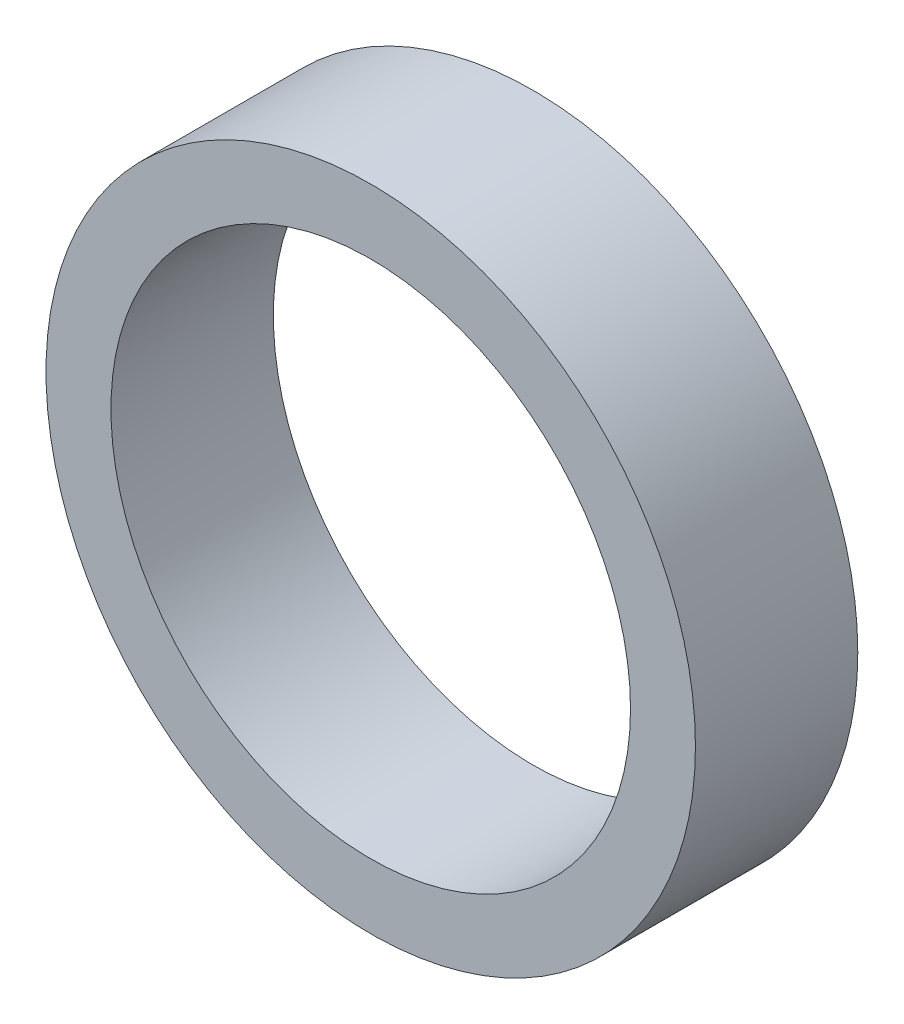
ISO-10303-21;
HEADER;
FILE_DESCRIPTION(('STEP AP214'),'2;1');
FILE_NAME('part.step','',(''),(''),'','','');
FILE_SCHEMA(('AUTOMOTIVE_DESIGN { 1 0 10303 214 1 1 1 1 }'));
ENDSEC;
DATA;
#1=APPLICATION_CONTEXT('core data for automotive mechanical design processes');
#2=APPLICATION_PROTOCOL_DEFINITION('international standard','automotive_design',2000,#1);
#3=PRODUCT_CONTEXT('',#1,'mechanical');
#4=PRODUCT('Part','Part','',(#3));
#5=PRODUCT_RELATED_PRODUCT_CATEGORY('part','',(#4));
#6=PRODUCT_DEFINITION_FORMATION('','',#4);
#7=PRODUCT_DEFINITION_CONTEXT('part definition',#1,'design');
#8=PRODUCT_DEFINITION('design','',#6,#7);
#9=PRODUCT_DEFINITION_SHAPE('','',#8);
#10=(LENGTH_UNIT() NAMED_UNIT(*) SI_UNIT(.MILLI.,.METRE.));
#11=(NAMED_UNIT(*) PLANE_ANGLE_UNIT() SI_UNIT($,.RADIAN.));
#12=(NAMED_UNIT(*) SI_UNIT($,.STERADIAN.) SOLID_ANGLE_UNIT());
#13=UNCERTAINTY_MEASURE_WITH_UNIT(LENGTH_MEASURE(1.E-05),#10,'distance_accuracy_value','');
#14=(GEOMETRIC_REPRESENTATION_CONTEXT(3) GLOBAL_UNCERTAINTY_ASSIGNED_CONTEXT((#13)) GLOBAL_UNIT_ASSIGNED_CONTEXT((#10,
#11,#12)) REPRESENTATION_CONTEXT('',''));
#15=CARTESIAN_POINT('',(0.,0.,0.));
#16=DIRECTION('',(0.,0.,1.));
#17=DIRECTION('',(1.,0.,0.));
#18=AXIS2_PLACEMENT_3D('',#15,#16,#17);
#19=CARTESIAN_POINT('',(0.,0.,10.));
#20=DIRECTION('',(0.,0.,-1.));
#21=DIRECTION('',(-1.,0.,0.));
#22=AXIS2_PLACEMENT_3D('',#19,#20,#21);
#23=CYLINDRICAL_SURFACE('',#22,20.);
#24=CARTESIAN_POINT('',(0.,0.,10.));
#25=DIRECTION('',(0.,0.,1.));
#26=DIRECTION('',(1.,0.,0.));
#27=AXIS2_PLACEMENT_3D('',#24,#25,#26);
#28=CIRCLE('',#27,20.);
#29=CARTESIAN_POINT('',(20.,0.,10.));
#30=VERTEX_POINT('',#29);
#31=EDGE_CURVE('E10',#30,#30,#28,.T.);
#32=ORIENTED_EDGE('',*,*,#31,.F.);
#33=EDGE_LOOP('',(#32));
#34=FACE_BOUND('',#33,.T.);
#35=CARTESIAN_POINT('',(0.,0.,0.));
#36=DIRECTION('',(0.,0.,1.));
#37=DIRECTION('',(1.,0.,0.));
#38=AXIS2_PLACEMENT_3D('',#35,#36,#37);
#39=CIRCLE('',#38,20.);
#40=CARTESIAN_POINT('',(20.,0.,0.));
#41=VERTEX_POINT('',#40);
#42=EDGE_CURVE('E33',#41,#41,#39,.T.);
#43=ORIENTED_EDGE('',*,*,#42,.T.);
#44=EDGE_LOOP('',(#43));
#45=FACE_BOUND('',#44,.T.);
#46=ADVANCED_FACE('F30',(#34,#45),#23,.T.);
#47=CARTESIAN_POINT('',(0.,0.,10.));
#48=DIRECTION('',(0.,0.,1.));
#49=DIRECTION('',(1.,0.,0.));
#50=AXIS2_PLACEMENT_3D('',#47,#48,#49);
#51=PLANE('',#50);
#52=CARTESIAN_POINT('',(0.,0.,10.));
#53=DIRECTION('',(0.,0.,1.));
#54=DIRECTION('',(1.,0.,0.));
#55=AXIS2_PLACEMENT_3D('',#52,#53,#54);
#56=CIRCLE('',#55,16.);
#57=CARTESIAN_POINT('',(16.,0.,10.));
#58=VERTEX_POINT('',#57);
#59=EDGE_CURVE('E42',#58,#58,#56,.T.);
#60=ORIENTED_EDGE('',*,*,#59,.F.);
#61=EDGE_LOOP('',(#60));
#62=FACE_BOUND('',#61,.T.);
#63=ORIENTED_EDGE('',*,*,#31,.T.);
#64=EDGE_LOOP('',(#63));
#65=FACE_BOUND('',#64,.T.);
#66=ADVANCED_FACE('F57',(#62,#65),#51,.T.);
#67=CARTESIAN_POINT('',(0.,0.,0.));
#68=DIRECTION('',(0.,0.,1.));
#69=DIRECTION('',(1.,0.,0.));
#70=AXIS2_PLACEMENT_3D('',#67,#68,#69);
#71=PLANE('',#70);
#72=CARTESIAN_POINT('',(0.,0.,0.));
#73=DIRECTION('',(0.,0.,1.));
#74=DIRECTION('',(1.,0.,0.));
#75=AXIS2_PLACEMENT_3D('',#72,#73,#74);
#76=CIRCLE('',#75,16.);
#77=CARTESIAN_POINT('',(16.,0.,0.));
#78=VERTEX_POINT('',#77);
#79=EDGE_CURVE('E40',#78,#78,#76,.T.);
#80=ORIENTED_EDGE('',*,*,#79,.T.);
#81=EDGE_LOOP('',(#80));
#82=FACE_BOUND('',#81,.T.);
#83=ORIENTED_EDGE('',*,*,#42,.F.);
#84=EDGE_LOOP('',(#83));
#85=FACE_BOUND('',#84,.T.);
#86=ADVANCED_FACE('F48',(#82,#85),#71,.F.);
#87=CARTESIAN_POINT('',(0.,0.,0.));
#88=DIRECTION('',(0.,0.,1.));
#89=DIRECTION('',(1.,0.,0.));
#90=AXIS2_PLACEMENT_3D('',#87,#88,#89);
#91=CYLINDRICAL_SURFACE('',#90,16.);
#92=ORIENTED_EDGE('',*,*,#79,.F.);
#93=EDGE_LOOP('',(#92));
#94=FACE_BOUND('',#93,.T.);
#95=ORIENTED_EDGE('',*,*,#59,.T.);
#96=EDGE_LOOP('',(#95));
#97=FACE_BOUND('',#96,.T.);
#98=ADVANCED_FACE('F51',(#94,#97),#91,.F.);
#99=CLOSED_SHELL('',(#46,#66,#86,#98));
#100=MANIFOLD_SOLID_BREP('B2',#99);
#101=ADVANCED_BREP_SHAPE_REPRESENTATION('',(#18,#100),#14);
#102=SHAPE_DEFINITION_REPRESENTATION(#9,#101);
ENDSEC;
END-ISO-10303-21;
